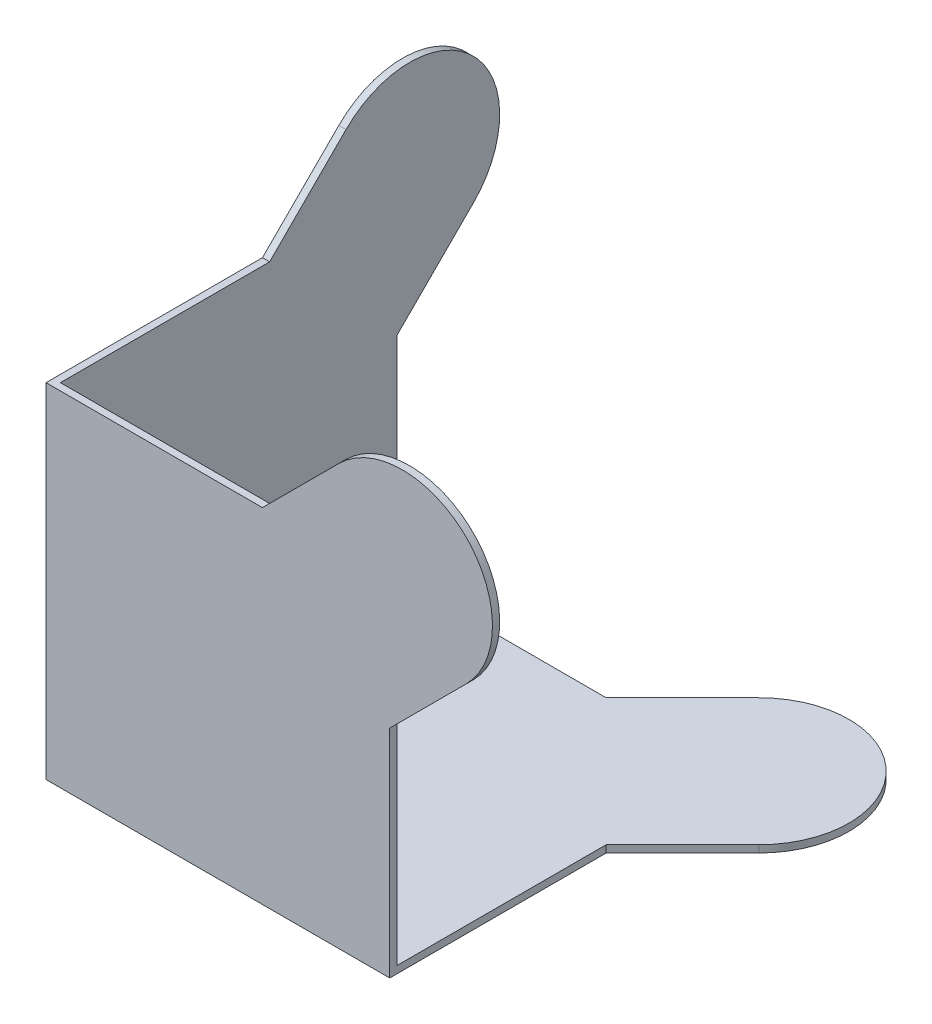
ISO-10303-21;
HEADER;
FILE_DESCRIPTION(('STEP AP214'),'2;1');
FILE_NAME('part.step','',(''),(''),'','','');
FILE_SCHEMA(('AUTOMOTIVE_DESIGN { 1 0 10303 214 1 1 1 1 }'));
ENDSEC;
DATA;
#1=APPLICATION_CONTEXT('core data for automotive mechanical design processes');
#2=APPLICATION_PROTOCOL_DEFINITION('international standard','automotive_design',2000,#1);
#3=PRODUCT_CONTEXT('',#1,'mechanical');
#4=PRODUCT('Part','Part','',(#3));
#5=PRODUCT_RELATED_PRODUCT_CATEGORY('part','',(#4));
#6=PRODUCT_DEFINITION_FORMATION('','',#4);
#7=PRODUCT_DEFINITION_CONTEXT('part definition',#1,'design');
#8=PRODUCT_DEFINITION('design','',#6,#7);
#9=PRODUCT_DEFINITION_SHAPE('','',#8);
#10=(LENGTH_UNIT() NAMED_UNIT(*) SI_UNIT(.MILLI.,.METRE.));
#11=(NAMED_UNIT(*) PLANE_ANGLE_UNIT() SI_UNIT($,.RADIAN.));
#12=(NAMED_UNIT(*) SI_UNIT($,.STERADIAN.) SOLID_ANGLE_UNIT());
#13=UNCERTAINTY_MEASURE_WITH_UNIT(LENGTH_MEASURE(1.E-05),#10,'distance_accuracy_value','');
#14=(GEOMETRIC_REPRESENTATION_CONTEXT(3) GLOBAL_UNCERTAINTY_ASSIGNED_CONTEXT((#13)) GLOBAL_UNIT_ASSIGNED_CONTEXT((#10,
#11,#12)) REPRESENTATION_CONTEXT('',''));
#15=CARTESIAN_POINT('',(0.,0.,0.));
#16=DIRECTION('',(0.,0.,1.));
#17=DIRECTION('',(1.,0.,0.));
#18=AXIS2_PLACEMENT_3D('',#15,#16,#17);
#19=CARTESIAN_POINT('',(49.5,49.4999999999995,-1.));
#20=DIRECTION('',(0.,0.,-1.));
#21=DIRECTION('',(-1.,0.,0.));
#22=AXIS2_PLACEMENT_3D('',#19,#20,#21);
#23=PLANE('',#22);
#24=DIRECTION('',(0.,1.,0.));
#25=VECTOR('',#24,1.);
#26=CARTESIAN_POINT('',(47.7322330470307,0.,-1.));
#27=LINE('',#26,#25);
#28=CARTESIAN_POINT('',(47.7322330470307,1.,-1.));
#29=VERTEX_POINT('',#28);
#30=CARTESIAN_POINT('',(47.7322330470307,30.0545635173697,-1.));
#31=VERTEX_POINT('',#30);
#32=EDGE_CURVE('E54',#29,#31,#27,.T.);
#33=ORIENTED_EDGE('',*,*,#32,.F.);
#34=DIRECTION('',(-1.,0.,0.));
#35=VECTOR('',#34,1.);
#36=CARTESIAN_POINT('',(49.5,1.,-1.));
#37=LINE('',#36,#35);
#38=CARTESIAN_POINT('',(1.,1.,-1.));
#39=VERTEX_POINT('',#38);
#40=EDGE_CURVE('E156',#29,#39,#37,.T.);
#41=ORIENTED_EDGE('',*,*,#40,.T.);
#42=DIRECTION('',(0.,1.,0.));
#43=VECTOR('',#42,1.);
#44=CARTESIAN_POINT('',(1.,49.4999999999995,-1.));
#45=LINE('',#44,#43);
#46=CARTESIAN_POINT('',(1.,47.7322330470328,-1.));
#47=VERTEX_POINT('',#46);
#48=EDGE_CURVE('E231',#39,#47,#45,.T.);
#49=ORIENTED_EDGE('',*,*,#48,.T.);
#50=DIRECTION('',(-1.,0.,0.));
#51=VECTOR('',#50,1.);
#52=CARTESIAN_POINT('',(0.,47.732233047036,-1.));
#53=LINE('',#52,#51);
#54=CARTESIAN_POINT('',(30.0545635173697,47.732233047036,-1.));
#55=VERTEX_POINT('',#54);
#56=EDGE_CURVE('E245',#55,#47,#53,.T.);
#57=ORIENTED_EDGE('',*,*,#56,.F.);
#58=DIRECTION('',(-0.707106781186653,-0.707106781186442,0.));
#59=VECTOR('',#58,1.);
#60=CARTESIAN_POINT('',(30.0545635173697,47.732233047036,-1.));
#61=LINE('',#60,#59);
#62=CARTESIAN_POINT('',(40.6611652351695,58.3388347648326,-1.));
#63=VERTEX_POINT('',#62);
#64=EDGE_CURVE('E242',#63,#55,#61,.T.);
#65=ORIENTED_EDGE('',*,*,#64,.F.);
#66=CARTESIAN_POINT('',(49.5,49.4999999999995,-1.));
#67=DIRECTION('',(0.,0.,1.));
#68=DIRECTION('',(-1.,0.,0.));
#69=AXIS2_PLACEMENT_3D('',#66,#67,#68);
#70=CIRCLE('',#69,12.5);
#71=CARTESIAN_POINT('',(58.3388347648305,40.6611652351663,-1.));
#72=VERTEX_POINT('',#71);
#73=EDGE_CURVE('E239',#72,#63,#70,.T.);
#74=ORIENTED_EDGE('',*,*,#73,.F.);
#75=DIRECTION('',(0.707106781186653,0.707106781186442,0.));
#76=VECTOR('',#75,1.);
#77=CARTESIAN_POINT('',(58.3388347648305,40.6611652351663,-1.));
#78=LINE('',#77,#76);
#79=EDGE_CURVE('E235',#31,#72,#78,.T.);
#80=ORIENTED_EDGE('',*,*,#79,.F.);
#81=EDGE_LOOP('',(#33,#41,#49,#57,#65,#74,#80));
#82=FACE_BOUND('',#81,.T.);
#83=ADVANCED_FACE('F39',(#82),#23,.T.);
#84=CARTESIAN_POINT('',(1.,49.5000000000002,-49.5));
#85=DIRECTION('',(-1.,0.,0.));
#86=DIRECTION('',(0.,0.,1.));
#87=AXIS2_PLACEMENT_3D('',#84,#85,#86);
#88=PLANE('',#87);
#89=DIRECTION('',(0.,0.,1.));
#90=VECTOR('',#89,1.);
#91=CARTESIAN_POINT('',(1.,1.,-49.5));
#92=LINE('',#91,#90);
#93=CARTESIAN_POINT('',(1.,1.,-47.7322330470346));
#94=VERTEX_POINT('',#93);
#95=EDGE_CURVE('E11',#94,#39,#92,.T.);
#96=ORIENTED_EDGE('',*,*,#95,.F.);
#97=DIRECTION('',(0.,1.,0.));
#98=VECTOR('',#97,1.);
#99=CARTESIAN_POINT('',(1.,0.,-47.7322330470346));
#100=LINE('',#99,#98);
#101=CARTESIAN_POINT('',(1.,30.05456351737,-47.7322330470346));
#102=VERTEX_POINT('',#101);
#103=EDGE_CURVE('E197',#94,#102,#100,.T.);
#104=ORIENTED_EDGE('',*,*,#103,.T.);
#105=DIRECTION('',(0.,0.707106781186583,-0.707106781186512));
#106=VECTOR('',#105,1.);
#107=CARTESIAN_POINT('',(1.,40.6611652351688,-58.3388347648323));
#108=LINE('',#107,#106);
#109=CARTESIAN_POINT('',(1.,40.6611652351688,-58.3388347648323));
#110=VERTEX_POINT('',#109);
#111=EDGE_CURVE('E199',#102,#110,#108,.T.);
#112=ORIENTED_EDGE('',*,*,#111,.T.);
#113=CARTESIAN_POINT('',(1.,49.5000000000002,-49.5));
#114=DIRECTION('',(1.,0.,0.));
#115=DIRECTION('',(0.,0.,1.));
#116=AXIS2_PLACEMENT_3D('',#113,#114,#115);
#117=CIRCLE('',#116,12.5);
#118=CARTESIAN_POINT('',(1.,58.3388347648316,-40.6611652351677));
#119=VERTEX_POINT('',#118);
#120=EDGE_CURVE('E202',#110,#119,#117,.T.);
#121=ORIENTED_EDGE('',*,*,#120,.T.);
#122=DIRECTION('',(0.,-0.707106781186583,0.707106781186512));
#123=VECTOR('',#122,1.);
#124=CARTESIAN_POINT('',(1.,47.7322330470328,-30.05456351737));
#125=LINE('',#124,#123);
#126=CARTESIAN_POINT('',(1.,47.7322330470328,-30.05456351737));
#127=VERTEX_POINT('',#126);
#128=EDGE_CURVE('E204',#119,#127,#125,.T.);
#129=ORIENTED_EDGE('',*,*,#128,.T.);
#130=DIRECTION('',(0.,0.,1.));
#131=VECTOR('',#130,1.);
#132=CARTESIAN_POINT('',(1.,47.7322330470328,0.));
#133=LINE('',#132,#131);
#134=EDGE_CURVE('E206',#127,#47,#133,.T.);
#135=ORIENTED_EDGE('',*,*,#134,.T.);
#136=ORIENTED_EDGE('',*,*,#48,.F.);
#137=EDGE_LOOP('',(#96,#104,#112,#121,#129,#135,#136));
#138=FACE_BOUND('',#137,.T.);
#139=ADVANCED_FACE('F326',(#138),#88,.F.);
#140=CARTESIAN_POINT('',(0.,0.,-1.));
#141=DIRECTION('',(-1.,0.,0.));
#142=DIRECTION('',(0.,0.,1.));
#143=AXIS2_PLACEMENT_3D('',#140,#141,#142);
#144=PLANE('',#143);
#145=DIRECTION('',(0.,0.,1.));
#146=VECTOR('',#145,1.);
#147=CARTESIAN_POINT('',(0.,0.,-1.));
#148=LINE('',#147,#146);
#149=CARTESIAN_POINT('',(0.,0.,-47.7322330470346));
#150=VERTEX_POINT('',#149);
#151=CARTESIAN_POINT('',(0.,0.,0.));
#152=VERTEX_POINT('',#151);
#153=EDGE_CURVE('E248',#150,#152,#148,.T.);
#154=ORIENTED_EDGE('',*,*,#153,.T.);
#155=DIRECTION('',(0.,-1.,0.));
#156=VECTOR('',#155,1.);
#157=CARTESIAN_POINT('',(0.,0.,0.));
#158=LINE('',#157,#156);
#159=CARTESIAN_POINT('',(0.,47.732233047036,0.));
#160=VERTEX_POINT('',#159);
#161=EDGE_CURVE('E233',#160,#152,#158,.T.);
#162=ORIENTED_EDGE('',*,*,#161,.F.);
#163=DIRECTION('',(0.,0.,1.));
#164=VECTOR('',#163,1.);
#165=CARTESIAN_POINT('',(0.,47.732233047036,-1.));
#166=LINE('',#165,#164);
#167=CARTESIAN_POINT('',(0.,47.7322330470328,-30.05456351737));
#168=VERTEX_POINT('',#167);
#169=EDGE_CURVE('E47',#168,#160,#166,.T.);
#170=ORIENTED_EDGE('',*,*,#169,.F.);
#171=DIRECTION('',(0.,-0.707106781186583,0.707106781186512));
#172=VECTOR('',#171,1.);
#173=CARTESIAN_POINT('',(0.,47.7322330470328,-30.05456351737));
#174=LINE('',#173,#172);
#175=CARTESIAN_POINT('',(0.,58.3388347648316,-40.6611652351677));
#176=VERTEX_POINT('',#175);
#177=EDGE_CURVE('E200',#176,#168,#174,.T.);
#178=ORIENTED_EDGE('',*,*,#177,.F.);
#179=CARTESIAN_POINT('',(0.,49.5000000000002,-49.5));
#180=DIRECTION('',(1.,0.,0.));
#181=DIRECTION('',(0.,0.,1.));
#182=AXIS2_PLACEMENT_3D('',#179,#180,#181);
#183=CIRCLE('',#182,12.5);
#184=CARTESIAN_POINT('',(0.,40.6611652351688,-58.3388347648323));
#185=VERTEX_POINT('',#184);
#186=EDGE_CURVE('E213',#185,#176,#183,.T.);
#187=ORIENTED_EDGE('',*,*,#186,.F.);
#188=DIRECTION('',(0.,0.707106781186583,-0.707106781186512));
#189=VECTOR('',#188,1.);
#190=CARTESIAN_POINT('',(0.,40.6611652351688,-58.3388347648323));
#191=LINE('',#190,#189);
#192=CARTESIAN_POINT('',(0.,30.05456351737,-47.7322330470346));
#193=VERTEX_POINT('',#192);
#194=EDGE_CURVE('E211',#193,#185,#191,.T.);
#195=ORIENTED_EDGE('',*,*,#194,.F.);
#196=DIRECTION('',(0.,1.,0.));
#197=VECTOR('',#196,1.);
#198=CARTESIAN_POINT('',(0.,0.,-47.7322330470346));
#199=LINE('',#198,#197);
#200=EDGE_CURVE('E196',#150,#193,#199,.T.);
#201=ORIENTED_EDGE('',*,*,#200,.F.);
#202=EDGE_LOOP('',(#154,#162,#170,#178,#187,#195,#201));
#203=FACE_BOUND('',#202,.T.);
#204=ADVANCED_FACE('F41',(#203),#144,.T.);
#205=CARTESIAN_POINT('',(0.,47.732233047036,-1.));
#206=DIRECTION('',(0.,1.,0.));
#207=DIRECTION('',(0.,0.,1.));
#208=AXIS2_PLACEMENT_3D('',#205,#206,#207);
#209=PLANE('',#208);
#210=ORIENTED_EDGE('',*,*,#169,.T.);
#211=DIRECTION('',(-1.,0.,0.));
#212=VECTOR('',#211,1.);
#213=CARTESIAN_POINT('',(0.,47.732233047036,0.));
#214=LINE('',#213,#212);
#215=CARTESIAN_POINT('',(30.0545635173697,47.732233047036,0.));
#216=VERTEX_POINT('',#215);
#217=EDGE_CURVE('E236',#216,#160,#214,.T.);
#218=ORIENTED_EDGE('',*,*,#217,.F.);
#219=DIRECTION('',(0.,0.,1.));
#220=VECTOR('',#219,1.);
#221=CARTESIAN_POINT('',(30.0545635173697,47.732233047036,-1.));
#222=LINE('',#221,#220);
#223=EDGE_CURVE('E266',#55,#216,#222,.T.);
#224=ORIENTED_EDGE('',*,*,#223,.F.);
#225=ORIENTED_EDGE('',*,*,#56,.T.);
#226=ORIENTED_EDGE('',*,*,#134,.F.);
#227=DIRECTION('',(-1.,0.,0.));
#228=VECTOR('',#227,1.);
#229=CARTESIAN_POINT('',(1.,47.7322330470328,-30.05456351737));
#230=LINE('',#229,#228);
#231=EDGE_CURVE('E209',#127,#168,#230,.T.);
#232=ORIENTED_EDGE('',*,*,#231,.T.);
#233=EDGE_LOOP('',(#210,#218,#224,#225,#226,#232));
#234=FACE_BOUND('',#233,.T.);
#235=ADVANCED_FACE('F288',(#234),#209,.T.);
#236=CARTESIAN_POINT('',(30.0545635173697,47.732233047036,-1.));
#237=DIRECTION('',(-0.707106781186442,0.707106781186653,0.));
#238=DIRECTION('',(-0.707106781186653,-0.707106781186442,0.));
#239=AXIS2_PLACEMENT_3D('',#236,#237,#238);
#240=PLANE('',#239);
#241=DIRECTION('',(-0.707106781186653,-0.707106781186442,0.));
#242=VECTOR('',#241,1.);
#243=CARTESIAN_POINT('',(30.0545635173697,47.732233047036,0.));
#244=LINE('',#243,#242);
#245=CARTESIAN_POINT('',(40.6611652351695,58.3388347648326,0.));
#246=VERTEX_POINT('',#245);
#247=EDGE_CURVE('E260',#246,#216,#244,.T.);
#248=ORIENTED_EDGE('',*,*,#247,.F.);
#249=DIRECTION('',(0.,0.,1.));
#250=VECTOR('',#249,1.);
#251=CARTESIAN_POINT('',(40.6611652351695,58.3388347648326,-1.));
#252=LINE('',#251,#250);
#253=EDGE_CURVE('E268',#63,#246,#252,.T.);
#254=ORIENTED_EDGE('',*,*,#253,.F.);
#255=ORIENTED_EDGE('',*,*,#64,.T.);
#256=ORIENTED_EDGE('',*,*,#223,.T.);
#257=EDGE_LOOP('',(#248,#254,#255,#256));
#258=FACE_BOUND('',#257,.T.);
#259=ADVANCED_FACE('F340',(#258),#240,.T.);
#260=CARTESIAN_POINT('',(49.5,49.4999999999995,-1.));
#261=DIRECTION('',(0.,0.,1.));
#262=DIRECTION('',(1.,0.,0.));
#263=AXIS2_PLACEMENT_3D('',#260,#261,#262);
#264=CYLINDRICAL_SURFACE('',#263,12.5);
#265=CARTESIAN_POINT('',(49.5,49.4999999999995,0.));
#266=DIRECTION('',(0.,0.,1.));
#267=DIRECTION('',(-1.,0.,0.));
#268=AXIS2_PLACEMENT_3D('',#265,#266,#267);
#269=CIRCLE('',#268,12.5);
#270=CARTESIAN_POINT('',(58.3388347648305,40.6611652351663,0.));
#271=VERTEX_POINT('',#270);
#272=EDGE_CURVE('E257',#271,#246,#269,.T.);
#273=ORIENTED_EDGE('',*,*,#272,.F.);
#274=DIRECTION('',(0.,0.,1.));
#275=VECTOR('',#274,1.);
#276=CARTESIAN_POINT('',(58.3388347648305,40.6611652351663,-1.));
#277=LINE('',#276,#275);
#278=EDGE_CURVE('E270',#72,#271,#277,.T.);
#279=ORIENTED_EDGE('',*,*,#278,.F.);
#280=ORIENTED_EDGE('',*,*,#73,.T.);
#281=ORIENTED_EDGE('',*,*,#253,.T.);
#282=EDGE_LOOP('',(#273,#279,#280,#281));
#283=FACE_BOUND('',#282,.T.);
#284=ADVANCED_FACE('F343',(#283),#264,.T.);
#285=CARTESIAN_POINT('',(58.3388347648305,40.6611652351663,-1.));
#286=DIRECTION('',(0.707106781186442,-0.707106781186653,0.));
#287=DIRECTION('',(0.707106781186653,0.707106781186442,0.));
#288=AXIS2_PLACEMENT_3D('',#285,#286,#287);
#289=PLANE('',#288);
#290=DIRECTION('',(0.707106781186653,0.707106781186442,0.));
#291=VECTOR('',#290,1.);
#292=CARTESIAN_POINT('',(58.3388347648305,40.6611652351663,0.));
#293=LINE('',#292,#291);
#294=CARTESIAN_POINT('',(47.7322330470307,30.0545635173697,0.));
#295=VERTEX_POINT('',#294);
#296=EDGE_CURVE('E254',#295,#271,#293,.T.);
#297=ORIENTED_EDGE('',*,*,#296,.F.);
#298=DIRECTION('',(0.,0.,1.));
#299=VECTOR('',#298,1.);
#300=CARTESIAN_POINT('',(47.7322330470307,30.0545635173697,-1.));
#301=LINE('',#300,#299);
#302=EDGE_CURVE('E272',#31,#295,#301,.T.);
#303=ORIENTED_EDGE('',*,*,#302,.F.);
#304=ORIENTED_EDGE('',*,*,#79,.T.);
#305=ORIENTED_EDGE('',*,*,#278,.T.);
#306=EDGE_LOOP('',(#297,#303,#304,#305));
#307=FACE_BOUND('',#306,.T.);
#308=ADVANCED_FACE('F347',(#307),#289,.T.);
#309=CARTESIAN_POINT('',(47.7322330470307,0.,-1.));
#310=DIRECTION('',(1.,0.,0.));
#311=DIRECTION('',(0.,0.,-1.));
#312=AXIS2_PLACEMENT_3D('',#309,#310,#311);
#313=PLANE('',#312);
#314=DIRECTION('',(0.,0.,1.));
#315=VECTOR('',#314,1.);
#316=CARTESIAN_POINT('',(47.7322330470307,0.,-1.));
#317=LINE('',#316,#315);
#318=CARTESIAN_POINT('',(47.7322330470337,0.,-30.0545635173701));
#319=VERTEX_POINT('',#318);
#320=CARTESIAN_POINT('',(47.7322330470307,0.,0.));
#321=VERTEX_POINT('',#320);
#322=EDGE_CURVE('E165',#319,#321,#317,.T.);
#323=ORIENTED_EDGE('',*,*,#322,.F.);
#324=DIRECTION('',(0.,-1.,0.));
#325=VECTOR('',#324,1.);
#326=CARTESIAN_POINT('',(47.7322330470337,1.,-30.0545635173701));
#327=LINE('',#326,#325);
#328=CARTESIAN_POINT('',(47.7322330470337,1.,-30.0545635173701));
#329=VERTEX_POINT('',#328);
#330=EDGE_CURVE('E161',#329,#319,#327,.T.);
#331=ORIENTED_EDGE('',*,*,#330,.F.);
#332=DIRECTION('',(0.,0.,-1.));
#333=VECTOR('',#332,1.);
#334=CARTESIAN_POINT('',(47.7322330470337,1.,0.));
#335=LINE('',#334,#333);
#336=EDGE_CURVE('E150',#29,#329,#335,.T.);
#337=ORIENTED_EDGE('',*,*,#336,.F.);
#338=ORIENTED_EDGE('',*,*,#32,.T.);
#339=ORIENTED_EDGE('',*,*,#302,.T.);
#340=DIRECTION('',(0.,1.,0.));
#341=VECTOR('',#340,1.);
#342=CARTESIAN_POINT('',(47.7322330470307,0.,0.));
#343=LINE('',#342,#341);
#344=EDGE_CURVE('E252',#321,#295,#343,.T.);
#345=ORIENTED_EDGE('',*,*,#344,.F.);
#346=EDGE_LOOP('',(#323,#331,#337,#338,#339,#345));
#347=FACE_BOUND('',#346,.T.);
#348=ADVANCED_FACE('F162',(#347),#313,.T.);
#349=CARTESIAN_POINT('',(0.,0.,-1.));
#350=DIRECTION('',(0.,-1.,0.));
#351=DIRECTION('',(0.,0.,-1.));
#352=AXIS2_PLACEMENT_3D('',#349,#350,#351);
#353=PLANE('',#352);
#354=DIRECTION('',(0.707106781186547,0.,-0.707106781186548));
#355=VECTOR('',#354,1.);
#356=CARTESIAN_POINT('',(58.3388347648319,0.,-40.6611652351684));
#357=LINE('',#356,#355);
#358=CARTESIAN_POINT('',(58.3388347648319,0.,-40.6611652351684));
#359=VERTEX_POINT('',#358);
#360=EDGE_CURVE('E183',#319,#359,#357,.T.);
#361=ORIENTED_EDGE('',*,*,#360,.F.);
#362=ORIENTED_EDGE('',*,*,#322,.T.);
#363=DIRECTION('',(1.,0.,0.));
#364=VECTOR('',#363,1.);
#365=CARTESIAN_POINT('',(0.,0.,0.));
#366=LINE('',#365,#364);
#367=EDGE_CURVE('E250',#152,#321,#366,.T.);
#368=ORIENTED_EDGE('',*,*,#367,.F.);
#369=ORIENTED_EDGE('',*,*,#153,.F.);
#370=DIRECTION('',(-1.,0.,0.));
#371=VECTOR('',#370,1.);
#372=CARTESIAN_POINT('',(1.,0.,-47.7322330470346));
#373=LINE('',#372,#371);
#374=CARTESIAN_POINT('',(30.05456351737,0.,-47.7322330470338));
#375=VERTEX_POINT('',#374);
#376=EDGE_CURVE('E228',#375,#150,#373,.T.);
#377=ORIENTED_EDGE('',*,*,#376,.F.);
#378=DIRECTION('',(-0.707106781186548,0.,0.707106781186548));
#379=VECTOR('',#378,1.);
#380=CARTESIAN_POINT('',(30.05456351737,0.,-47.7322330470338));
#381=LINE('',#380,#379);
#382=CARTESIAN_POINT('',(40.6611652351682,0.,-58.338834764832));
#383=VERTEX_POINT('',#382);
#384=EDGE_CURVE('E158',#383,#375,#381,.T.);
#385=ORIENTED_EDGE('',*,*,#384,.F.);
#386=CARTESIAN_POINT('',(49.5,0.,-49.5000000000002));
#387=DIRECTION('',(0.,1.,0.));
#388=DIRECTION('',(0.,0.,-1.));
#389=AXIS2_PLACEMENT_3D('',#386,#387,#388);
#390=CIRCLE('',#389,12.5);
#391=EDGE_CURVE('E185',#359,#383,#390,.T.);
#392=ORIENTED_EDGE('',*,*,#391,.F.);
#393=EDGE_LOOP('',(#361,#362,#368,#369,#377,#385,#392));
#394=FACE_BOUND('',#393,.T.);
#395=ADVANCED_FACE('F282',(#394),#353,.T.);
#396=CARTESIAN_POINT('',(49.5,49.4999999999995,0.));
#397=DIRECTION('',(0.,0.,-1.));
#398=DIRECTION('',(-1.,0.,0.));
#399=AXIS2_PLACEMENT_3D('',#396,#397,#398);
#400=PLANE('',#399);
#401=ORIENTED_EDGE('',*,*,#344,.T.);
#402=ORIENTED_EDGE('',*,*,#296,.T.);
#403=ORIENTED_EDGE('',*,*,#272,.T.);
#404=ORIENTED_EDGE('',*,*,#247,.T.);
#405=ORIENTED_EDGE('',*,*,#217,.T.);
#406=ORIENTED_EDGE('',*,*,#161,.T.);
#407=ORIENTED_EDGE('',*,*,#367,.T.);
#408=EDGE_LOOP('',(#401,#402,#403,#404,#405,#406,#407));
#409=FACE_BOUND('',#408,.T.);
#410=ADVANCED_FACE('F284',(#409),#400,.F.);
#411=CARTESIAN_POINT('',(1.,0.,-47.7322330470346));
#412=DIRECTION('',(0.,0.,1.));
#413=DIRECTION('',(1.,0.,0.));
#414=AXIS2_PLACEMENT_3D('',#411,#412,#413);
#415=PLANE('',#414);
#416=ORIENTED_EDGE('',*,*,#200,.T.);
#417=DIRECTION('',(-1.,0.,0.));
#418=VECTOR('',#417,1.);
#419=CARTESIAN_POINT('',(1.,30.05456351737,-47.7322330470346));
#420=LINE('',#419,#418);
#421=EDGE_CURVE('E225',#102,#193,#420,.T.);
#422=ORIENTED_EDGE('',*,*,#421,.F.);
#423=ORIENTED_EDGE('',*,*,#103,.F.);
#424=DIRECTION('',(-1.,0.,0.));
#425=VECTOR('',#424,1.);
#426=CARTESIAN_POINT('',(0.,1.,-47.7322330470338));
#427=LINE('',#426,#425);
#428=CARTESIAN_POINT('',(30.05456351737,1.,-47.7322330470338));
#429=VERTEX_POINT('',#428);
#430=EDGE_CURVE('E179',#429,#94,#427,.T.);
#431=ORIENTED_EDGE('',*,*,#430,.F.);
#432=DIRECTION('',(0.,-1.,0.));
#433=VECTOR('',#432,1.);
#434=CARTESIAN_POINT('',(30.05456351737,1.,-47.7322330470338));
#435=LINE('',#434,#433);
#436=EDGE_CURVE('E182',#429,#375,#435,.T.);
#437=ORIENTED_EDGE('',*,*,#436,.T.);
#438=ORIENTED_EDGE('',*,*,#376,.T.);
#439=EDGE_LOOP('',(#416,#422,#423,#431,#437,#438));
#440=FACE_BOUND('',#439,.T.);
#441=ADVANCED_FACE('F306',(#440),#415,.F.);
#442=CARTESIAN_POINT('',(1.,40.6611652351688,-58.3388347648323));
#443=DIRECTION('',(0.,0.707106781186512,0.707106781186583));
#444=DIRECTION('',(0.,-0.707106781186583,0.707106781186512));
#445=AXIS2_PLACEMENT_3D('',#442,#443,#444);
#446=PLANE('',#445);
#447=ORIENTED_EDGE('',*,*,#194,.T.);
#448=DIRECTION('',(-1.,0.,0.));
#449=VECTOR('',#448,1.);
#450=CARTESIAN_POINT('',(1.,40.6611652351688,-58.3388347648323));
#451=LINE('',#450,#449);
#452=EDGE_CURVE('E222',#110,#185,#451,.T.);
#453=ORIENTED_EDGE('',*,*,#452,.F.);
#454=ORIENTED_EDGE('',*,*,#111,.F.);
#455=ORIENTED_EDGE('',*,*,#421,.T.);
#456=EDGE_LOOP('',(#447,#453,#454,#455));
#457=FACE_BOUND('',#456,.T.);
#458=ADVANCED_FACE('F302',(#457),#446,.F.);
#459=CARTESIAN_POINT('',(1.,49.5000000000002,-49.5));
#460=DIRECTION('',(-1.,0.,0.));
#461=DIRECTION('',(0.,0.,1.));
#462=AXIS2_PLACEMENT_3D('',#459,#460,#461);
#463=CYLINDRICAL_SURFACE('',#462,12.5);
#464=ORIENTED_EDGE('',*,*,#186,.T.);
#465=DIRECTION('',(-1.,0.,0.));
#466=VECTOR('',#465,1.);
#467=CARTESIAN_POINT('',(1.,58.3388347648316,-40.6611652351677));
#468=LINE('',#467,#466);
#469=EDGE_CURVE('E219',#119,#176,#468,.T.);
#470=ORIENTED_EDGE('',*,*,#469,.F.);
#471=ORIENTED_EDGE('',*,*,#120,.F.);
#472=ORIENTED_EDGE('',*,*,#452,.T.);
#473=EDGE_LOOP('',(#464,#470,#471,#472));
#474=FACE_BOUND('',#473,.T.);
#475=ADVANCED_FACE('F299',(#474),#463,.T.);
#476=CARTESIAN_POINT('',(1.,47.7322330470328,-30.05456351737));
#477=DIRECTION('',(0.,-0.707106781186512,-0.707106781186583));
#478=DIRECTION('',(0.,0.707106781186583,-0.707106781186512));
#479=AXIS2_PLACEMENT_3D('',#476,#477,#478);
#480=PLANE('',#479);
#481=ORIENTED_EDGE('',*,*,#177,.T.);
#482=ORIENTED_EDGE('',*,*,#231,.F.);
#483=ORIENTED_EDGE('',*,*,#128,.F.);
#484=ORIENTED_EDGE('',*,*,#469,.T.);
#485=EDGE_LOOP('',(#481,#482,#483,#484));
#486=FACE_BOUND('',#485,.T.);
#487=ADVANCED_FACE('F294',(#486),#480,.F.);
#488=CARTESIAN_POINT('',(58.3388347648319,1.,-40.6611652351684));
#489=DIRECTION('',(-0.707106781186548,0.,-0.707106781186547));
#490=DIRECTION('',(-0.707106781186547,0.,0.707106781186548));
#491=AXIS2_PLACEMENT_3D('',#488,#489,#490);
#492=PLANE('',#491);
#493=ORIENTED_EDGE('',*,*,#360,.T.);
#494=DIRECTION('',(0.,-1.,0.));
#495=VECTOR('',#494,1.);
#496=CARTESIAN_POINT('',(58.3388347648319,1.,-40.6611652351684));
#497=LINE('',#496,#495);
#498=CARTESIAN_POINT('',(58.3388347648319,1.,-40.6611652351684));
#499=VERTEX_POINT('',#498);
#500=EDGE_CURVE('E168',#499,#359,#497,.T.);
#501=ORIENTED_EDGE('',*,*,#500,.F.);
#502=DIRECTION('',(0.707106781186547,0.,-0.707106781186548));
#503=VECTOR('',#502,1.);
#504=CARTESIAN_POINT('',(58.3388347648319,1.,-40.6611652351684));
#505=LINE('',#504,#503);
#506=EDGE_CURVE('E154',#329,#499,#505,.T.);
#507=ORIENTED_EDGE('',*,*,#506,.F.);
#508=ORIENTED_EDGE('',*,*,#330,.T.);
#509=EDGE_LOOP('',(#493,#501,#507,#508));
#510=FACE_BOUND('',#509,.T.);
#511=ADVANCED_FACE('F170',(#510),#492,.F.);
#512=CARTESIAN_POINT('',(49.5,1.,-49.5000000000002));
#513=DIRECTION('',(0.,-1.,0.));
#514=DIRECTION('',(0.,0.,-1.));
#515=AXIS2_PLACEMENT_3D('',#512,#513,#514);
#516=CYLINDRICAL_SURFACE('',#515,12.5);
#517=ORIENTED_EDGE('',*,*,#391,.T.);
#518=DIRECTION('',(0.,-1.,0.));
#519=VECTOR('',#518,1.);
#520=CARTESIAN_POINT('',(40.6611652351682,1.,-58.338834764832));
#521=LINE('',#520,#519);
#522=CARTESIAN_POINT('',(40.6611652351682,1.,-58.338834764832));
#523=VERTEX_POINT('',#522);
#524=EDGE_CURVE('E191',#523,#383,#521,.T.);
#525=ORIENTED_EDGE('',*,*,#524,.F.);
#526=CARTESIAN_POINT('',(49.5,1.,-49.5000000000002));
#527=DIRECTION('',(0.,1.,0.));
#528=DIRECTION('',(0.,0.,-1.));
#529=AXIS2_PLACEMENT_3D('',#526,#527,#528);
#530=CIRCLE('',#529,12.5);
#531=EDGE_CURVE('E173',#499,#523,#530,.T.);
#532=ORIENTED_EDGE('',*,*,#531,.F.);
#533=ORIENTED_EDGE('',*,*,#500,.T.);
#534=EDGE_LOOP('',(#517,#525,#532,#533));
#535=FACE_BOUND('',#534,.T.);
#536=ADVANCED_FACE('F316',(#535),#516,.T.);
#537=CARTESIAN_POINT('',(30.05456351737,1.,-47.7322330470338));
#538=DIRECTION('',(0.707106781186547,0.,0.707106781186547));
#539=DIRECTION('',(0.707106781186548,0.,-0.707106781186548));
#540=AXIS2_PLACEMENT_3D('',#537,#538,#539);
#541=PLANE('',#540);
#542=ORIENTED_EDGE('',*,*,#384,.T.);
#543=ORIENTED_EDGE('',*,*,#436,.F.);
#544=DIRECTION('',(-0.707106781186548,0.,0.707106781186548));
#545=VECTOR('',#544,1.);
#546=CARTESIAN_POINT('',(30.05456351737,1.,-47.7322330470338));
#547=LINE('',#546,#545);
#548=EDGE_CURVE('E175',#523,#429,#547,.T.);
#549=ORIENTED_EDGE('',*,*,#548,.F.);
#550=ORIENTED_EDGE('',*,*,#524,.T.);
#551=EDGE_LOOP('',(#542,#543,#549,#550));
#552=FACE_BOUND('',#551,.T.);
#553=ADVANCED_FACE('F312',(#552),#541,.F.);
#554=CARTESIAN_POINT('',(49.5,1.,-49.5000000000002));
#555=DIRECTION('',(0.,-1.,0.));
#556=DIRECTION('',(0.,0.,-1.));
#557=AXIS2_PLACEMENT_3D('',#554,#555,#556);
#558=PLANE('',#557);
#559=ORIENTED_EDGE('',*,*,#40,.F.);
#560=ORIENTED_EDGE('',*,*,#336,.T.);
#561=ORIENTED_EDGE('',*,*,#506,.T.);
#562=ORIENTED_EDGE('',*,*,#531,.T.);
#563=ORIENTED_EDGE('',*,*,#548,.T.);
#564=ORIENTED_EDGE('',*,*,#430,.T.);
#565=ORIENTED_EDGE('',*,*,#95,.T.);
#566=EDGE_LOOP('',(#559,#560,#561,#562,#563,#564,#565));
#567=FACE_BOUND('',#566,.T.);
#568=ADVANCED_FACE('F152',(#567),#558,.F.);
#569=CLOSED_SHELL('',(#83,#139,#204,#235,#259,#284,#308,#348,#395,#410,#441,#458,#475,#487,#511,
#536,#553,#568));
#570=MANIFOLD_SOLID_BREP('B2',#569);
#571=ADVANCED_BREP_SHAPE_REPRESENTATION('',(#18,#570),#14);
#572=SHAPE_DEFINITION_REPRESENTATION(#9,#571);
ENDSEC;
END-ISO-10303-21;
